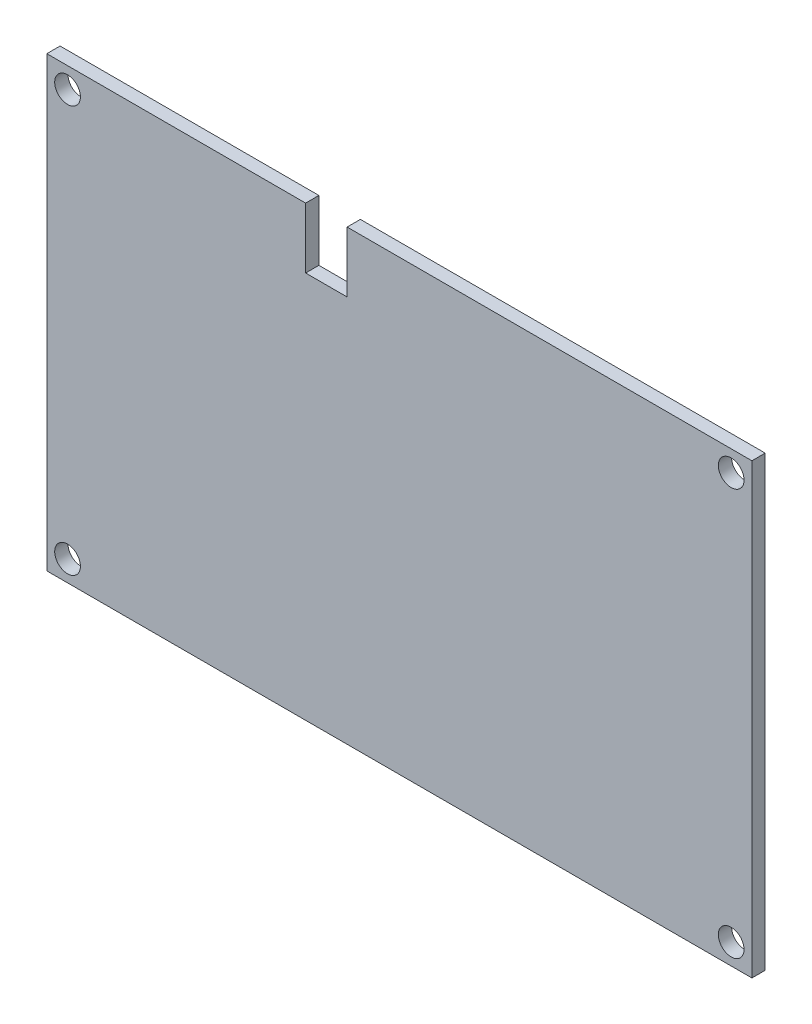
ISO-10303-21;
HEADER;
FILE_DESCRIPTION(('STEP AP214'),'2;1');
FILE_NAME('part.step','',(''),(''),'','','');
FILE_SCHEMA(('AUTOMOTIVE_DESIGN { 1 0 10303 214 1 1 1 1 }'));
ENDSEC;
DATA;
#1=APPLICATION_CONTEXT('core data for automotive mechanical design processes');
#2=APPLICATION_PROTOCOL_DEFINITION('international standard','automotive_design',2000,#1);
#3=PRODUCT_CONTEXT('',#1,'mechanical');
#4=PRODUCT('Part','Part','',(#3));
#5=PRODUCT_RELATED_PRODUCT_CATEGORY('part','',(#4));
#6=PRODUCT_DEFINITION_FORMATION('','',#4);
#7=PRODUCT_DEFINITION_CONTEXT('part definition',#1,'design');
#8=PRODUCT_DEFINITION('design','',#6,#7);
#9=PRODUCT_DEFINITION_SHAPE('','',#8);
#10=(LENGTH_UNIT() NAMED_UNIT(*) SI_UNIT(.MILLI.,.METRE.));
#11=(NAMED_UNIT(*) PLANE_ANGLE_UNIT() SI_UNIT($,.RADIAN.));
#12=(NAMED_UNIT(*) SI_UNIT($,.STERADIAN.) SOLID_ANGLE_UNIT());
#13=UNCERTAINTY_MEASURE_WITH_UNIT(LENGTH_MEASURE(1.E-05),#10,'distance_accuracy_value','');
#14=(GEOMETRIC_REPRESENTATION_CONTEXT(3) GLOBAL_UNCERTAINTY_ASSIGNED_CONTEXT((#13)) GLOBAL_UNIT_ASSIGNED_CONTEXT((#10,
#11,#12)) REPRESENTATION_CONTEXT('',''));
#15=CARTESIAN_POINT('',(0.,0.,0.));
#16=DIRECTION('',(0.,0.,1.));
#17=DIRECTION('',(1.,0.,0.));
#18=AXIS2_PLACEMENT_3D('',#15,#16,#17);
#19=CARTESIAN_POINT('',(0.,54.,1.6));
#20=DIRECTION('',(0.,0.,-1.));
#21=DIRECTION('',(-1.,0.,0.));
#22=AXIS2_PLACEMENT_3D('',#19,#20,#21);
#23=PLANE('',#22);
#24=CARTESIAN_POINT('',(82.5,2.5,1.6));
#25=DIRECTION('',(0.,0.,1.));
#26=DIRECTION('',(1.,0.,0.));
#27=AXIS2_PLACEMENT_3D('',#24,#25,#26);
#28=CIRCLE('',#27,1.54999999999999);
#29=CARTESIAN_POINT('',(84.05,2.5,1.6));
#30=VERTEX_POINT('',#29);
#31=EDGE_CURVE('E187',#30,#30,#28,.T.);
#32=ORIENTED_EDGE('',*,*,#31,.F.);
#33=EDGE_LOOP('',(#32));
#34=FACE_BOUND('',#33,.T.);
#35=CARTESIAN_POINT('',(2.5,51.5,1.6));
#36=DIRECTION('',(0.,0.,1.));
#37=DIRECTION('',(1.,0.,0.));
#38=AXIS2_PLACEMENT_3D('',#35,#36,#37);
#39=CIRCLE('',#38,1.55);
#40=CARTESIAN_POINT('',(4.05,51.5,1.6));
#41=VERTEX_POINT('',#40);
#42=EDGE_CURVE('E133',#41,#41,#39,.T.);
#43=ORIENTED_EDGE('',*,*,#42,.F.);
#44=EDGE_LOOP('',(#43));
#45=FACE_BOUND('',#44,.T.);
#46=DIRECTION('',(0.,-1.,0.));
#47=VECTOR('',#46,1.);
#48=CARTESIAN_POINT('',(0.,0.,1.6));
#49=LINE('',#48,#47);
#50=CARTESIAN_POINT('',(0.,54.,1.6));
#51=VERTEX_POINT('',#50);
#52=CARTESIAN_POINT('',(0.,0.,1.6));
#53=VERTEX_POINT('',#52);
#54=EDGE_CURVE('E144',#51,#53,#49,.T.);
#55=ORIENTED_EDGE('',*,*,#54,.T.);
#56=DIRECTION('',(1.,0.,0.));
#57=VECTOR('',#56,1.);
#58=CARTESIAN_POINT('',(0.,0.,1.6));
#59=LINE('',#58,#57);
#60=CARTESIAN_POINT('',(85.,0.,1.6));
#61=VERTEX_POINT('',#60);
#62=EDGE_CURVE('E92',#53,#61,#59,.T.);
#63=ORIENTED_EDGE('',*,*,#62,.T.);
#64=DIRECTION('',(0.,1.,0.));
#65=VECTOR('',#64,1.);
#66=CARTESIAN_POINT('',(85.,0.,1.6));
#67=LINE('',#66,#65);
#68=CARTESIAN_POINT('',(85.,54.,1.6));
#69=VERTEX_POINT('',#68);
#70=EDGE_CURVE('E159',#61,#69,#67,.T.);
#71=ORIENTED_EDGE('',*,*,#70,.T.);
#72=DIRECTION('',(-1.,0.,0.));
#73=VECTOR('',#72,1.);
#74=CARTESIAN_POINT('',(36.2,54.,1.6));
#75=LINE('',#74,#73);
#76=CARTESIAN_POINT('',(36.2,54.,1.6));
#77=VERTEX_POINT('',#76);
#78=EDGE_CURVE('E172',#69,#77,#75,.T.);
#79=ORIENTED_EDGE('',*,*,#78,.T.);
#80=DIRECTION('',(0.,-1.,0.));
#81=VECTOR('',#80,1.);
#82=CARTESIAN_POINT('',(36.2,46.7,1.6));
#83=LINE('',#82,#81);
#84=CARTESIAN_POINT('',(36.2,46.7,1.6));
#85=VERTEX_POINT('',#84);
#86=EDGE_CURVE('E111',#77,#85,#83,.T.);
#87=ORIENTED_EDGE('',*,*,#86,.T.);
#88=DIRECTION('',(-1.,0.,0.));
#89=VECTOR('',#88,1.);
#90=CARTESIAN_POINT('',(31.2,46.7,1.6));
#91=LINE('',#90,#89);
#92=CARTESIAN_POINT('',(31.2,46.7,1.6));
#93=VERTEX_POINT('',#92);
#94=EDGE_CURVE('E105',#85,#93,#91,.T.);
#95=ORIENTED_EDGE('',*,*,#94,.T.);
#96=DIRECTION('',(0.,1.,0.));
#97=VECTOR('',#96,1.);
#98=CARTESIAN_POINT('',(31.2,54.,1.6));
#99=LINE('',#98,#97);
#100=CARTESIAN_POINT('',(31.2,54.,1.6));
#101=VERTEX_POINT('',#100);
#102=EDGE_CURVE('E109',#93,#101,#99,.T.);
#103=ORIENTED_EDGE('',*,*,#102,.T.);
#104=DIRECTION('',(-1.,0.,0.));
#105=VECTOR('',#104,1.);
#106=CARTESIAN_POINT('',(0.,54.,1.6));
#107=LINE('',#106,#105);
#108=EDGE_CURVE('E49',#101,#51,#107,.T.);
#109=ORIENTED_EDGE('',*,*,#108,.T.);
#110=EDGE_LOOP('',(#55,#63,#71,#79,#87,#95,#103,#109));
#111=FACE_BOUND('',#110,.T.);
#112=CARTESIAN_POINT('',(82.5,51.5,1.6));
#113=DIRECTION('',(0.,0.,1.));
#114=DIRECTION('',(1.,0.,0.));
#115=AXIS2_PLACEMENT_3D('',#112,#113,#114);
#116=CIRCLE('',#115,1.54999999999999);
#117=CARTESIAN_POINT('',(84.05,51.5,1.6));
#118=VERTEX_POINT('',#117);
#119=EDGE_CURVE('E181',#118,#118,#116,.T.);
#120=ORIENTED_EDGE('',*,*,#119,.F.);
#121=EDGE_LOOP('',(#120));
#122=FACE_BOUND('',#121,.T.);
#123=CARTESIAN_POINT('',(2.5,2.5,1.6));
#124=DIRECTION('',(0.,0.,1.));
#125=DIRECTION('',(1.,0.,0.));
#126=AXIS2_PLACEMENT_3D('',#123,#124,#125);
#127=CIRCLE('',#126,1.55);
#128=CARTESIAN_POINT('',(4.05,2.5,1.6));
#129=VERTEX_POINT('',#128);
#130=EDGE_CURVE('E193',#129,#129,#127,.T.);
#131=ORIENTED_EDGE('',*,*,#130,.F.);
#132=EDGE_LOOP('',(#131));
#133=FACE_BOUND('',#132,.T.);
#134=ADVANCED_FACE('F32',(#34,#45,#111,#122,#133),#23,.F.);
#135=CARTESIAN_POINT('',(0.,54.,0.));
#136=DIRECTION('',(0.,0.,-1.));
#137=DIRECTION('',(-1.,0.,0.));
#138=AXIS2_PLACEMENT_3D('',#135,#136,#137);
#139=PLANE('',#138);
#140=CARTESIAN_POINT('',(82.5,2.5,0.));
#141=DIRECTION('',(0.,0.,1.));
#142=DIRECTION('',(1.,0.,0.));
#143=AXIS2_PLACEMENT_3D('',#140,#141,#142);
#144=CIRCLE('',#143,1.54999999999999);
#145=CARTESIAN_POINT('',(84.05,2.5,0.));
#146=VERTEX_POINT('',#145);
#147=EDGE_CURVE('E190',#146,#146,#144,.T.);
#148=ORIENTED_EDGE('',*,*,#147,.T.);
#149=EDGE_LOOP('',(#148));
#150=FACE_BOUND('',#149,.T.);
#151=CARTESIAN_POINT('',(2.5,51.5,0.));
#152=DIRECTION('',(0.,0.,1.));
#153=DIRECTION('',(1.,0.,0.));
#154=AXIS2_PLACEMENT_3D('',#151,#152,#153);
#155=CIRCLE('',#154,1.55);
#156=CARTESIAN_POINT('',(4.05,51.5,0.));
#157=VERTEX_POINT('',#156);
#158=EDGE_CURVE('E178',#157,#157,#155,.T.);
#159=ORIENTED_EDGE('',*,*,#158,.T.);
#160=EDGE_LOOP('',(#159));
#161=FACE_BOUND('',#160,.T.);
#162=DIRECTION('',(0.,-1.,0.));
#163=VECTOR('',#162,1.);
#164=CARTESIAN_POINT('',(0.,0.,0.));
#165=LINE('',#164,#163);
#166=CARTESIAN_POINT('',(0.,54.,0.));
#167=VERTEX_POINT('',#166);
#168=CARTESIAN_POINT('',(0.,0.,0.));
#169=VERTEX_POINT('',#168);
#170=EDGE_CURVE('E129',#167,#169,#165,.T.);
#171=ORIENTED_EDGE('',*,*,#170,.F.);
#172=DIRECTION('',(-1.,0.,0.));
#173=VECTOR('',#172,1.);
#174=CARTESIAN_POINT('',(0.,54.,0.));
#175=LINE('',#174,#173);
#176=CARTESIAN_POINT('',(31.2,54.,0.));
#177=VERTEX_POINT('',#176);
#178=EDGE_CURVE('E84',#177,#167,#175,.T.);
#179=ORIENTED_EDGE('',*,*,#178,.F.);
#180=DIRECTION('',(0.,1.,0.));
#181=VECTOR('',#180,1.);
#182=CARTESIAN_POINT('',(31.2,54.,0.));
#183=LINE('',#182,#181);
#184=CARTESIAN_POINT('',(31.2,46.7,0.));
#185=VERTEX_POINT('',#184);
#186=EDGE_CURVE('E78',#185,#177,#183,.T.);
#187=ORIENTED_EDGE('',*,*,#186,.F.);
#188=DIRECTION('',(-1.,0.,0.));
#189=VECTOR('',#188,1.);
#190=CARTESIAN_POINT('',(31.2,46.7,0.));
#191=LINE('',#190,#189);
#192=CARTESIAN_POINT('',(36.2,46.7,0.));
#193=VERTEX_POINT('',#192);
#194=EDGE_CURVE('E119',#193,#185,#191,.T.);
#195=ORIENTED_EDGE('',*,*,#194,.F.);
#196=DIRECTION('',(0.,-1.,0.));
#197=VECTOR('',#196,1.);
#198=CARTESIAN_POINT('',(36.2,46.7,0.));
#199=LINE('',#198,#197);
#200=CARTESIAN_POINT('',(36.2,54.,0.));
#201=VERTEX_POINT('',#200);
#202=EDGE_CURVE('E139',#201,#193,#199,.T.);
#203=ORIENTED_EDGE('',*,*,#202,.F.);
#204=DIRECTION('',(-1.,0.,0.));
#205=VECTOR('',#204,1.);
#206=CARTESIAN_POINT('',(36.2,54.,0.));
#207=LINE('',#206,#205);
#208=CARTESIAN_POINT('',(85.,54.,0.));
#209=VERTEX_POINT('',#208);
#210=EDGE_CURVE('E137',#209,#201,#207,.T.);
#211=ORIENTED_EDGE('',*,*,#210,.F.);
#212=DIRECTION('',(0.,1.,0.));
#213=VECTOR('',#212,1.);
#214=CARTESIAN_POINT('',(85.,0.,0.));
#215=LINE('',#214,#213);
#216=CARTESIAN_POINT('',(85.,0.,0.));
#217=VERTEX_POINT('',#216);
#218=EDGE_CURVE('E135',#217,#209,#215,.T.);
#219=ORIENTED_EDGE('',*,*,#218,.F.);
#220=DIRECTION('',(1.,0.,0.));
#221=VECTOR('',#220,1.);
#222=CARTESIAN_POINT('',(0.,0.,0.));
#223=LINE('',#222,#221);
#224=EDGE_CURVE('E132',#169,#217,#223,.T.);
#225=ORIENTED_EDGE('',*,*,#224,.F.);
#226=EDGE_LOOP('',(#171,#179,#187,#195,#203,#211,#219,#225));
#227=FACE_BOUND('',#226,.T.);
#228=CARTESIAN_POINT('',(82.5,51.5,0.));
#229=DIRECTION('',(0.,0.,1.));
#230=DIRECTION('',(1.,0.,0.));
#231=AXIS2_PLACEMENT_3D('',#228,#229,#230);
#232=CIRCLE('',#231,1.54999999999999);
#233=CARTESIAN_POINT('',(84.05,51.5,0.));
#234=VERTEX_POINT('',#233);
#235=EDGE_CURVE('E184',#234,#234,#232,.T.);
#236=ORIENTED_EDGE('',*,*,#235,.T.);
#237=EDGE_LOOP('',(#236));
#238=FACE_BOUND('',#237,.T.);
#239=CARTESIAN_POINT('',(2.5,2.5,0.));
#240=DIRECTION('',(0.,0.,1.));
#241=DIRECTION('',(1.,0.,0.));
#242=AXIS2_PLACEMENT_3D('',#239,#240,#241);
#243=CIRCLE('',#242,1.55);
#244=CARTESIAN_POINT('',(4.05,2.5,0.));
#245=VERTEX_POINT('',#244);
#246=EDGE_CURVE('E196',#245,#245,#243,.T.);
#247=ORIENTED_EDGE('',*,*,#246,.T.);
#248=EDGE_LOOP('',(#247));
#249=FACE_BOUND('',#248,.T.);
#250=ADVANCED_FACE('F163',(#150,#161,#227,#238,#249),#139,.T.);
#251=CARTESIAN_POINT('',(0.,0.,1.6));
#252=DIRECTION('',(1.,0.,0.));
#253=DIRECTION('',(0.,0.,-1.));
#254=AXIS2_PLACEMENT_3D('',#251,#252,#253);
#255=PLANE('',#254);
#256=ORIENTED_EDGE('',*,*,#170,.T.);
#257=DIRECTION('',(0.,0.,-1.));
#258=VECTOR('',#257,1.);
#259=CARTESIAN_POINT('',(0.,0.,1.6));
#260=LINE('',#259,#258);
#261=EDGE_CURVE('E11',#53,#169,#260,.T.);
#262=ORIENTED_EDGE('',*,*,#261,.F.);
#263=ORIENTED_EDGE('',*,*,#54,.F.);
#264=DIRECTION('',(0.,0.,-1.));
#265=VECTOR('',#264,1.);
#266=CARTESIAN_POINT('',(0.,54.,1.6));
#267=LINE('',#266,#265);
#268=EDGE_CURVE('E125',#51,#167,#267,.T.);
#269=ORIENTED_EDGE('',*,*,#268,.T.);
#270=EDGE_LOOP('',(#256,#262,#263,#269));
#271=FACE_BOUND('',#270,.T.);
#272=ADVANCED_FACE('F34',(#271),#255,.F.);
#273=CARTESIAN_POINT('',(0.,0.,1.6));
#274=DIRECTION('',(0.,1.,0.));
#275=DIRECTION('',(0.,0.,1.));
#276=AXIS2_PLACEMENT_3D('',#273,#274,#275);
#277=PLANE('',#276);
#278=ORIENTED_EDGE('',*,*,#224,.T.);
#279=DIRECTION('',(0.,0.,-1.));
#280=VECTOR('',#279,1.);
#281=CARTESIAN_POINT('',(85.,0.,1.6));
#282=LINE('',#281,#280);
#283=EDGE_CURVE('E41',#61,#217,#282,.T.);
#284=ORIENTED_EDGE('',*,*,#283,.F.);
#285=ORIENTED_EDGE('',*,*,#62,.F.);
#286=ORIENTED_EDGE('',*,*,#261,.T.);
#287=EDGE_LOOP('',(#278,#284,#285,#286));
#288=FACE_BOUND('',#287,.T.);
#289=ADVANCED_FACE('F231',(#288),#277,.F.);
#290=CARTESIAN_POINT('',(85.,0.,1.6));
#291=DIRECTION('',(-1.,0.,0.));
#292=DIRECTION('',(0.,0.,1.));
#293=AXIS2_PLACEMENT_3D('',#290,#291,#292);
#294=PLANE('',#293);
#295=ORIENTED_EDGE('',*,*,#218,.T.);
#296=DIRECTION('',(0.,0.,-1.));
#297=VECTOR('',#296,1.);
#298=CARTESIAN_POINT('',(85.,54.,1.6));
#299=LINE('',#298,#297);
#300=EDGE_CURVE('E151',#69,#209,#299,.T.);
#301=ORIENTED_EDGE('',*,*,#300,.F.);
#302=ORIENTED_EDGE('',*,*,#70,.F.);
#303=ORIENTED_EDGE('',*,*,#283,.T.);
#304=EDGE_LOOP('',(#295,#301,#302,#303));
#305=FACE_BOUND('',#304,.T.);
#306=ADVANCED_FACE('F157',(#305),#294,.F.);
#307=CARTESIAN_POINT('',(36.2,54.,1.6));
#308=DIRECTION('',(0.,-1.,0.));
#309=DIRECTION('',(0.,0.,-1.));
#310=AXIS2_PLACEMENT_3D('',#307,#308,#309);
#311=PLANE('',#310);
#312=ORIENTED_EDGE('',*,*,#210,.T.);
#313=DIRECTION('',(0.,0.,-1.));
#314=VECTOR('',#313,1.);
#315=CARTESIAN_POINT('',(36.2,54.,1.6));
#316=LINE('',#315,#314);
#317=EDGE_CURVE('E148',#77,#201,#316,.T.);
#318=ORIENTED_EDGE('',*,*,#317,.F.);
#319=ORIENTED_EDGE('',*,*,#78,.F.);
#320=ORIENTED_EDGE('',*,*,#300,.T.);
#321=EDGE_LOOP('',(#312,#318,#319,#320));
#322=FACE_BOUND('',#321,.T.);
#323=ADVANCED_FACE('F168',(#322),#311,.F.);
#324=CARTESIAN_POINT('',(36.2,46.7,1.6));
#325=DIRECTION('',(1.,0.,0.));
#326=DIRECTION('',(0.,0.,-1.));
#327=AXIS2_PLACEMENT_3D('',#324,#325,#326);
#328=PLANE('',#327);
#329=ORIENTED_EDGE('',*,*,#202,.T.);
#330=DIRECTION('',(0.,0.,-1.));
#331=VECTOR('',#330,1.);
#332=CARTESIAN_POINT('',(36.2,46.7,1.6));
#333=LINE('',#332,#331);
#334=EDGE_CURVE('E120',#85,#193,#333,.T.);
#335=ORIENTED_EDGE('',*,*,#334,.F.);
#336=ORIENTED_EDGE('',*,*,#86,.F.);
#337=ORIENTED_EDGE('',*,*,#317,.T.);
#338=EDGE_LOOP('',(#329,#335,#336,#337));
#339=FACE_BOUND('',#338,.T.);
#340=ADVANCED_FACE('F171',(#339),#328,.F.);
#341=CARTESIAN_POINT('',(31.2,46.7,1.6));
#342=DIRECTION('',(0.,-1.,0.));
#343=DIRECTION('',(0.,0.,-1.));
#344=AXIS2_PLACEMENT_3D('',#341,#342,#343);
#345=PLANE('',#344);
#346=ORIENTED_EDGE('',*,*,#194,.T.);
#347=DIRECTION('',(0.,0.,-1.));
#348=VECTOR('',#347,1.);
#349=CARTESIAN_POINT('',(31.2,46.7,1.6));
#350=LINE('',#349,#348);
#351=EDGE_CURVE('E116',#93,#185,#350,.T.);
#352=ORIENTED_EDGE('',*,*,#351,.F.);
#353=ORIENTED_EDGE('',*,*,#94,.F.);
#354=ORIENTED_EDGE('',*,*,#334,.T.);
#355=EDGE_LOOP('',(#346,#352,#353,#354));
#356=FACE_BOUND('',#355,.T.);
#357=ADVANCED_FACE('F117',(#356),#345,.F.);
#358=CARTESIAN_POINT('',(31.2,54.,1.6));
#359=DIRECTION('',(-1.,0.,0.));
#360=DIRECTION('',(0.,0.,1.));
#361=AXIS2_PLACEMENT_3D('',#358,#359,#360);
#362=PLANE('',#361);
#363=ORIENTED_EDGE('',*,*,#186,.T.);
#364=DIRECTION('',(0.,0.,-1.));
#365=VECTOR('',#364,1.);
#366=CARTESIAN_POINT('',(31.2,54.,1.6));
#367=LINE('',#366,#365);
#368=EDGE_CURVE('E121',#101,#177,#367,.T.);
#369=ORIENTED_EDGE('',*,*,#368,.F.);
#370=ORIENTED_EDGE('',*,*,#102,.F.);
#371=ORIENTED_EDGE('',*,*,#351,.T.);
#372=EDGE_LOOP('',(#363,#369,#370,#371));
#373=FACE_BOUND('',#372,.T.);
#374=ADVANCED_FACE('F123',(#373),#362,.F.);
#375=CARTESIAN_POINT('',(0.,54.,1.6));
#376=DIRECTION('',(0.,-1.,0.));
#377=DIRECTION('',(0.,0.,-1.));
#378=AXIS2_PLACEMENT_3D('',#375,#376,#377);
#379=PLANE('',#378);
#380=ORIENTED_EDGE('',*,*,#178,.T.);
#381=ORIENTED_EDGE('',*,*,#268,.F.);
#382=ORIENTED_EDGE('',*,*,#108,.F.);
#383=ORIENTED_EDGE('',*,*,#368,.T.);
#384=EDGE_LOOP('',(#380,#381,#382,#383));
#385=FACE_BOUND('',#384,.T.);
#386=ADVANCED_FACE('F219',(#385),#379,.F.);
#387=CARTESIAN_POINT('',(2.5,51.5,1.6));
#388=DIRECTION('',(0.,0.,-1.));
#389=DIRECTION('',(-1.,0.,0.));
#390=AXIS2_PLACEMENT_3D('',#387,#388,#389);
#391=CYLINDRICAL_SURFACE('',#390,1.55);
#392=ORIENTED_EDGE('',*,*,#42,.T.);
#393=EDGE_LOOP('',(#392));
#394=FACE_BOUND('',#393,.T.);
#395=ORIENTED_EDGE('',*,*,#158,.F.);
#396=EDGE_LOOP('',(#395));
#397=FACE_BOUND('',#396,.T.);
#398=ADVANCED_FACE('F216',(#394,#397),#391,.F.);
#399=CARTESIAN_POINT('',(82.5,51.5,1.6));
#400=DIRECTION('',(0.,0.,-1.));
#401=DIRECTION('',(-1.,0.,0.));
#402=AXIS2_PLACEMENT_3D('',#399,#400,#401);
#403=CYLINDRICAL_SURFACE('',#402,1.54999999999999);
#404=ORIENTED_EDGE('',*,*,#119,.T.);
#405=EDGE_LOOP('',(#404));
#406=FACE_BOUND('',#405,.T.);
#407=ORIENTED_EDGE('',*,*,#235,.F.);
#408=EDGE_LOOP('',(#407));
#409=FACE_BOUND('',#408,.T.);
#410=ADVANCED_FACE('F295',(#406,#409),#403,.F.);
#411=CARTESIAN_POINT('',(82.5,2.5,1.6));
#412=DIRECTION('',(0.,0.,-1.));
#413=DIRECTION('',(-1.,0.,0.));
#414=AXIS2_PLACEMENT_3D('',#411,#412,#413);
#415=CYLINDRICAL_SURFACE('',#414,1.54999999999999);
#416=ORIENTED_EDGE('',*,*,#31,.T.);
#417=EDGE_LOOP('',(#416));
#418=FACE_BOUND('',#417,.T.);
#419=ORIENTED_EDGE('',*,*,#147,.F.);
#420=EDGE_LOOP('',(#419));
#421=FACE_BOUND('',#420,.T.);
#422=ADVANCED_FACE('F303',(#418,#421),#415,.F.);
#423=CARTESIAN_POINT('',(2.5,2.5,1.6));
#424=DIRECTION('',(0.,0.,-1.));
#425=DIRECTION('',(-1.,0.,0.));
#426=AXIS2_PLACEMENT_3D('',#423,#424,#425);
#427=CYLINDRICAL_SURFACE('',#426,1.55);
#428=ORIENTED_EDGE('',*,*,#130,.T.);
#429=EDGE_LOOP('',(#428));
#430=FACE_BOUND('',#429,.T.);
#431=ORIENTED_EDGE('',*,*,#246,.F.);
#432=EDGE_LOOP('',(#431));
#433=FACE_BOUND('',#432,.T.);
#434=ADVANCED_FACE('F202',(#430,#433),#427,.F.);
#435=CLOSED_SHELL('',(#134,#250,#272,#289,#306,#323,#340,#357,#374,#386,#398,#410,#422,#434));
#436=MANIFOLD_SOLID_BREP('B2',#435);
#437=ADVANCED_BREP_SHAPE_REPRESENTATION('',(#18,#436),#14);
#438=SHAPE_DEFINITION_REPRESENTATION(#9,#437);
ENDSEC;
END-ISO-10303-21;
